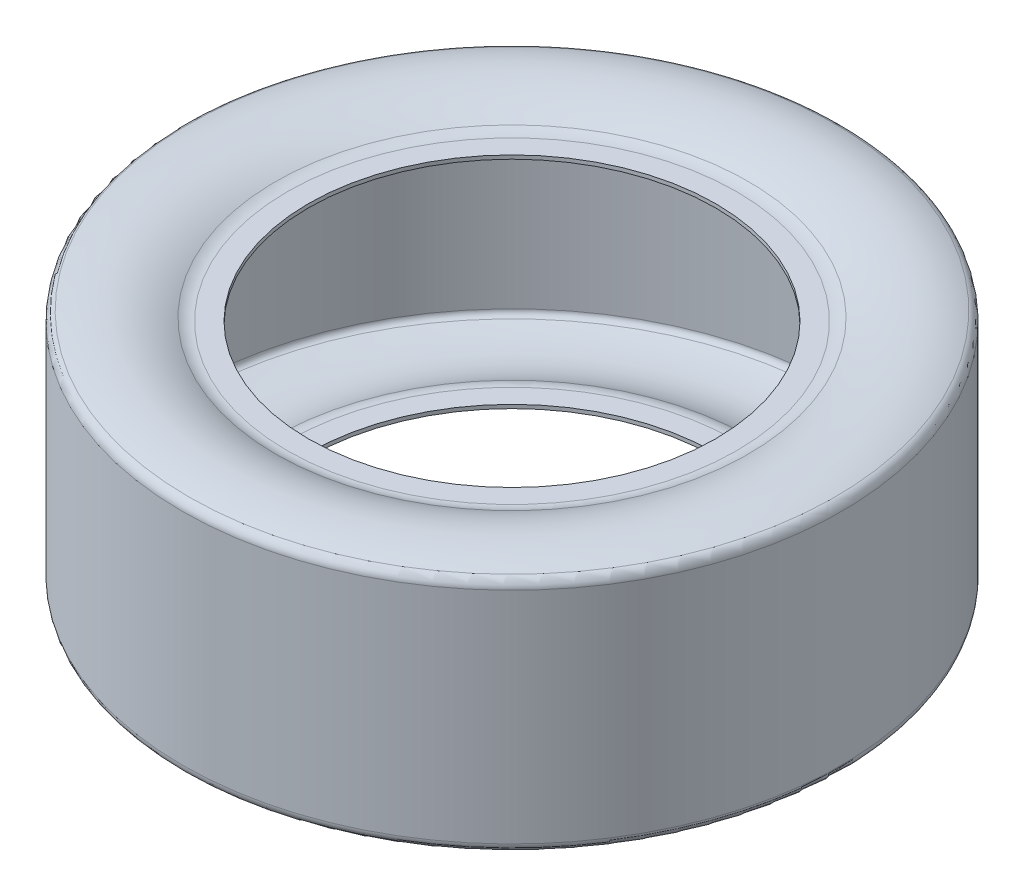
ISO-10303-21;
HEADER;
FILE_DESCRIPTION(('STEP AP214'),'2;1');
FILE_NAME('part.step','',(''),(''),'','','');
FILE_SCHEMA(('AUTOMOTIVE_DESIGN { 1 0 10303 214 1 1 1 1 }'));
ENDSEC;
DATA;
#1=APPLICATION_CONTEXT('core data for automotive mechanical design processes');
#2=APPLICATION_PROTOCOL_DEFINITION('international standard','automotive_design',2000,#1);
#3=PRODUCT_CONTEXT('',#1,'mechanical');
#4=PRODUCT('Part','Part','',(#3));
#5=PRODUCT_RELATED_PRODUCT_CATEGORY('part','',(#4));
#6=PRODUCT_DEFINITION_FORMATION('','',#4);
#7=PRODUCT_DEFINITION_CONTEXT('part definition',#1,'design');
#8=PRODUCT_DEFINITION('design','',#6,#7);
#9=PRODUCT_DEFINITION_SHAPE('','',#8);
#10=(LENGTH_UNIT() NAMED_UNIT(*) SI_UNIT(.MILLI.,.METRE.));
#11=(NAMED_UNIT(*) PLANE_ANGLE_UNIT() SI_UNIT($,.RADIAN.));
#12=(NAMED_UNIT(*) SI_UNIT($,.STERADIAN.) SOLID_ANGLE_UNIT());
#13=UNCERTAINTY_MEASURE_WITH_UNIT(LENGTH_MEASURE(1.E-05),#10,'distance_accuracy_value','');
#14=(GEOMETRIC_REPRESENTATION_CONTEXT(3) GLOBAL_UNCERTAINTY_ASSIGNED_CONTEXT((#13)) GLOBAL_UNIT_ASSIGNED_CONTEXT((#10,
#11,#12)) REPRESENTATION_CONTEXT('',''));
#15=CARTESIAN_POINT('',(0.,0.,0.));
#16=DIRECTION('',(0.,0.,1.));
#17=DIRECTION('',(1.,0.,0.));
#18=AXIS2_PLACEMENT_3D('',#15,#16,#17);
#19=CARTESIAN_POINT('',(0.,-44.45,0.));
#20=DIRECTION('',(0.,1.,0.));
#21=DIRECTION('',(0.,0.,1.));
#22=AXIS2_PLACEMENT_3D('',#19,#20,#21);
#23=CYLINDRICAL_SURFACE('',#22,263.7);
#24=CARTESIAN_POINT('',(0.,-88.9,0.));
#25=DIRECTION('',(0.,1.,0.));
#26=DIRECTION('',(0.,0.,1.));
#27=AXIS2_PLACEMENT_3D('',#24,#25,#26);
#28=CIRCLE('',#27,263.7);
#29=CARTESIAN_POINT('',(0.,-88.9,263.7));
#30=VERTEX_POINT('',#29);
#31=EDGE_CURVE('E241',#30,#30,#28,.F.);
#32=ORIENTED_EDGE('',*,*,#31,.T.);
#33=EDGE_LOOP('',(#32));
#34=FACE_BOUND('',#33,.T.);
#35=CARTESIAN_POINT('',(0.,88.9,0.));
#36=DIRECTION('',(0.,1.,0.));
#37=DIRECTION('',(0.,0.,1.));
#38=AXIS2_PLACEMENT_3D('',#35,#36,#37);
#39=CIRCLE('',#38,263.7);
#40=CARTESIAN_POINT('',(0.,88.9,263.7));
#41=VERTEX_POINT('',#40);
#42=EDGE_CURVE('E238',#41,#41,#39,.T.);
#43=ORIENTED_EDGE('',*,*,#42,.T.);
#44=EDGE_LOOP('',(#43));
#45=FACE_BOUND('',#44,.T.);
#46=ADVANCED_FACE('F14',(#34,#45),#23,.F.);
#47=CARTESIAN_POINT('',(0.,-88.9,0.));
#48=DIRECTION('',(0.,1.,0.));
#49=DIRECTION('',(0.,0.,1.));
#50=AXIS2_PLACEMENT_3D('',#47,#48,#49);
#51=TOROIDAL_SURFACE('',#50,258.7,4.99999999999994);
#52=ORIENTED_EDGE('',*,*,#31,.F.);
#53=EDGE_LOOP('',(#52));
#54=FACE_BOUND('',#53,.T.);
#55=CARTESIAN_POINT('',(0.,-93.5989720176161,0.));
#56=DIRECTION('',(0.,1.,0.));
#57=DIRECTION('',(0.,0.,1.));
#58=AXIS2_PLACEMENT_3D('',#55,#56,#57);
#59=CIRCLE('',#58,260.408701839895);
#60=CARTESIAN_POINT('',(0.,-93.5989720176161,260.408701839895));
#61=VERTEX_POINT('',#60);
#62=EDGE_CURVE('E219',#61,#61,#59,.F.);
#63=ORIENTED_EDGE('',*,*,#62,.T.);
#64=EDGE_LOOP('',(#63));
#65=FACE_BOUND('',#64,.T.);
#66=ADVANCED_FACE('F232',(#54,#65),#51,.F.);
#67=CARTESIAN_POINT('',(0.,88.9,0.));
#68=DIRECTION('',(0.,1.,0.));
#69=DIRECTION('',(0.,0.,1.));
#70=AXIS2_PLACEMENT_3D('',#67,#68,#69);
#71=TOROIDAL_SURFACE('',#70,258.7,4.99999999999994);
#72=CARTESIAN_POINT('',(0.,93.5989720176161,0.));
#73=DIRECTION('',(0.,1.,0.));
#74=DIRECTION('',(0.,0.,1.));
#75=AXIS2_PLACEMENT_3D('',#72,#73,#74);
#76=CIRCLE('',#75,260.408701839895);
#77=CARTESIAN_POINT('',(0.,93.5989720176161,260.408701839895));
#78=VERTEX_POINT('',#77);
#79=EDGE_CURVE('E216',#78,#78,#76,.T.);
#80=ORIENTED_EDGE('',*,*,#79,.T.);
#81=EDGE_LOOP('',(#80));
#82=FACE_BOUND('',#81,.T.);
#83=ORIENTED_EDGE('',*,*,#42,.F.);
#84=EDGE_LOOP('',(#83));
#85=FACE_BOUND('',#84,.T.);
#86=ADVANCED_FACE('F228',(#82,#85),#71,.F.);
#87=CARTESIAN_POINT('',(0.,-15.5341676680611,0.));
#88=DIRECTION('',(0.,1.,0.));
#89=DIRECTION('',(0.,0.,1.));
#90=AXIS2_PLACEMENT_3D('',#87,#88,#89);
#91=TOROIDAL_SURFACE('',#90,232.021753732297,83.0658323319388);
#92=ORIENTED_EDGE('',*,*,#62,.F.);
#93=EDGE_LOOP('',(#92));
#94=FACE_BOUND('',#93,.T.);
#95=CARTESIAN_POINT('',(0.,-88.6539500098942,0.));
#96=DIRECTION('',(0.,1.,0.));
#97=DIRECTION('',(0.,0.,1.));
#98=AXIS2_PLACEMENT_3D('',#95,#96,#97);
#99=CIRCLE('',#98,192.608178262914);
#100=CARTESIAN_POINT('',(0.,-88.6539500098942,192.608178262914));
#101=VERTEX_POINT('',#100);
#102=EDGE_CURVE('E180',#101,#101,#99,.T.);
#103=ORIENTED_EDGE('',*,*,#102,.F.);
#104=EDGE_LOOP('',(#103));
#105=FACE_BOUND('',#104,.T.);
#106=ADVANCED_FACE('F225',(#94,#105),#91,.F.);
#107=CARTESIAN_POINT('',(0.,15.5341676680611,0.));
#108=DIRECTION('',(0.,1.,0.));
#109=DIRECTION('',(0.,0.,1.));
#110=AXIS2_PLACEMENT_3D('',#107,#108,#109);
#111=TOROIDAL_SURFACE('',#110,232.021753732297,83.0658323319388);
#112=CARTESIAN_POINT('',(0.,88.6539500098942,0.));
#113=DIRECTION('',(0.,1.,0.));
#114=DIRECTION('',(0.,0.,1.));
#115=AXIS2_PLACEMENT_3D('',#112,#113,#114);
#116=CIRCLE('',#115,192.608178262914);
#117=CARTESIAN_POINT('',(0.,88.6539500098942,192.608178262914));
#118=VERTEX_POINT('',#117);
#119=EDGE_CURVE('E176',#118,#118,#116,.F.);
#120=ORIENTED_EDGE('',*,*,#119,.F.);
#121=EDGE_LOOP('',(#120));
#122=FACE_BOUND('',#121,.T.);
#123=ORIENTED_EDGE('',*,*,#79,.F.);
#124=EDGE_LOOP('',(#123));
#125=FACE_BOUND('',#124,.T.);
#126=ADVANCED_FACE('F200',(#122,#125),#111,.F.);
#127=CARTESIAN_POINT('',(0.,-108.9,0.));
#128=DIRECTION('',(0.,1.,0.));
#129=DIRECTION('',(0.,0.,1.));
#130=AXIS2_PLACEMENT_3D('',#127,#128,#129);
#131=TOROIDAL_SURFACE('',#130,181.695,23.0000000000001);
#132=ORIENTED_EDGE('',*,*,#102,.T.);
#133=EDGE_LOOP('',(#132));
#134=FACE_BOUND('',#133,.T.);
#135=CARTESIAN_POINT('',(0.,-85.8999999999999,0.));
#136=DIRECTION('',(0.,-1.,0.));
#137=DIRECTION('',(0.,0.,-1.));
#138=AXIS2_PLACEMENT_3D('',#135,#136,#137);
#139=CIRCLE('',#138,181.695000000036);
#140=CARTESIAN_POINT('',(0.,-85.8999999999999,-181.695000000036));
#141=VERTEX_POINT('',#140);
#142=EDGE_CURVE('E179',#141,#141,#139,.F.);
#143=ORIENTED_EDGE('',*,*,#142,.F.);
#144=EDGE_LOOP('',(#143));
#145=FACE_BOUND('',#144,.T.);
#146=ADVANCED_FACE('F196',(#134,#145),#131,.T.);
#147=CARTESIAN_POINT('',(0.,108.9,0.));
#148=DIRECTION('',(0.,1.,0.));
#149=DIRECTION('',(0.,0.,1.));
#150=AXIS2_PLACEMENT_3D('',#147,#148,#149);
#151=TOROIDAL_SURFACE('',#150,181.695,23.0000000000001);
#152=CARTESIAN_POINT('',(0.,85.8999999999999,0.));
#153=DIRECTION('',(0.,1.,0.));
#154=DIRECTION('',(0.,0.,-1.));
#155=AXIS2_PLACEMENT_3D('',#152,#153,#154);
#156=CIRCLE('',#155,181.695000000036);
#157=CARTESIAN_POINT('',(0.,85.8999999999999,-181.695000000036));
#158=VERTEX_POINT('',#157);
#159=EDGE_CURVE('E140',#158,#158,#156,.F.);
#160=ORIENTED_EDGE('',*,*,#159,.F.);
#161=EDGE_LOOP('',(#160));
#162=FACE_BOUND('',#161,.T.);
#163=ORIENTED_EDGE('',*,*,#119,.T.);
#164=EDGE_LOOP('',(#163));
#165=FACE_BOUND('',#164,.T.);
#166=ADVANCED_FACE('F162',(#162,#165),#151,.T.);
#167=CARTESIAN_POINT('',(0.,-85.8999999999999,-164.825));
#168=DIRECTION('',(0.,1.,0.));
#169=DIRECTION('',(0.,0.,1.));
#170=AXIS2_PLACEMENT_3D('',#167,#168,#169);
#171=PLANE('',#170);
#172=CARTESIAN_POINT('',(0.,-85.8999999999999,0.));
#173=DIRECTION('',(0.,1.,0.));
#174=DIRECTION('',(0.,0.,1.));
#175=AXIS2_PLACEMENT_3D('',#172,#173,#174);
#176=CIRCLE('',#175,164.825);
#177=CARTESIAN_POINT('',(0.,-85.8999999999999,164.825));
#178=VERTEX_POINT('',#177);
#179=EDGE_CURVE('E17',#178,#178,#176,.F.);
#180=ORIENTED_EDGE('',*,*,#179,.T.);
#181=EDGE_LOOP('',(#180));
#182=FACE_BOUND('',#181,.T.);
#183=ORIENTED_EDGE('',*,*,#142,.T.);
#184=EDGE_LOOP('',(#183));
#185=FACE_BOUND('',#184,.T.);
#186=ADVANCED_FACE('F157',(#182,#185),#171,.T.);
#187=CARTESIAN_POINT('',(0.,85.9,-181.695000000036));
#188=DIRECTION('',(0.,-1.,0.));
#189=DIRECTION('',(0.,0.,-1.));
#190=AXIS2_PLACEMENT_3D('',#187,#188,#189);
#191=PLANE('',#190);
#192=CARTESIAN_POINT('',(0.,85.8999999999999,0.));
#193=DIRECTION('',(0.,1.,0.));
#194=DIRECTION('',(0.,0.,1.));
#195=AXIS2_PLACEMENT_3D('',#192,#193,#194);
#196=CIRCLE('',#195,164.825);
#197=CARTESIAN_POINT('',(0.,85.8999999999999,164.825));
#198=VERTEX_POINT('',#197);
#199=EDGE_CURVE('E254',#198,#198,#196,.T.);
#200=ORIENTED_EDGE('',*,*,#199,.T.);
#201=EDGE_LOOP('',(#200));
#202=FACE_BOUND('',#201,.T.);
#203=ORIENTED_EDGE('',*,*,#159,.T.);
#204=EDGE_LOOP('',(#203));
#205=FACE_BOUND('',#204,.T.);
#206=ADVANCED_FACE('F147',(#202,#205),#191,.T.);
#207=CARTESIAN_POINT('',(0.,-87.3999999999999,0.));
#208=DIRECTION('',(0.,1.,0.));
#209=DIRECTION('',(0.,0.,1.));
#210=AXIS2_PLACEMENT_3D('',#207,#208,#209);
#211=CYLINDRICAL_SURFACE('',#210,164.825);
#212=ORIENTED_EDGE('',*,*,#179,.F.);
#213=EDGE_LOOP('',(#212));
#214=FACE_BOUND('',#213,.T.);
#215=CARTESIAN_POINT('',(0.,-88.9,0.));
#216=DIRECTION('',(0.,1.,0.));
#217=DIRECTION('',(0.,0.,1.));
#218=AXIS2_PLACEMENT_3D('',#215,#216,#217);
#219=CIRCLE('',#218,164.825);
#220=CARTESIAN_POINT('',(0.,-88.9,164.825));
#221=VERTEX_POINT('',#220);
#222=EDGE_CURVE('E252',#221,#221,#219,.T.);
#223=ORIENTED_EDGE('',*,*,#222,.F.);
#224=EDGE_LOOP('',(#223));
#225=FACE_BOUND('',#224,.T.);
#226=ADVANCED_FACE('F156',(#214,#225),#211,.F.);
#227=CARTESIAN_POINT('',(0.,87.3999999999999,0.));
#228=DIRECTION('',(0.,1.,0.));
#229=DIRECTION('',(0.,0.,1.));
#230=AXIS2_PLACEMENT_3D('',#227,#228,#229);
#231=CYLINDRICAL_SURFACE('',#230,164.825);
#232=CARTESIAN_POINT('',(0.,88.9,0.));
#233=DIRECTION('',(0.,1.,0.));
#234=DIRECTION('',(0.,0.,1.));
#235=AXIS2_PLACEMENT_3D('',#232,#233,#234);
#236=CIRCLE('',#235,164.825);
#237=CARTESIAN_POINT('',(0.,88.9,164.825));
#238=VERTEX_POINT('',#237);
#239=EDGE_CURVE('E249',#238,#238,#236,.F.);
#240=ORIENTED_EDGE('',*,*,#239,.F.);
#241=EDGE_LOOP('',(#240));
#242=FACE_BOUND('',#241,.T.);
#243=ORIENTED_EDGE('',*,*,#199,.F.);
#244=EDGE_LOOP('',(#243));
#245=FACE_BOUND('',#244,.T.);
#246=ADVANCED_FACE('F110',(#242,#245),#231,.F.);
#247=CARTESIAN_POINT('',(0.,-88.9,-181.695));
#248=DIRECTION('',(0.,-1.,0.));
#249=DIRECTION('',(0.,0.,-1.));
#250=AXIS2_PLACEMENT_3D('',#247,#248,#249);
#251=PLANE('',#250);
#252=ORIENTED_EDGE('',*,*,#222,.T.);
#253=EDGE_LOOP('',(#252));
#254=FACE_BOUND('',#253,.T.);
#255=CARTESIAN_POINT('',(0.,-88.9,0.));
#256=DIRECTION('',(0.,1.,0.));
#257=DIRECTION('',(0.,0.,-1.));
#258=AXIS2_PLACEMENT_3D('',#255,#256,#257);
#259=CIRCLE('',#258,181.695);
#260=CARTESIAN_POINT('',(0.,-88.9,-181.695));
#261=VERTEX_POINT('',#260);
#262=EDGE_CURVE('E127',#261,#261,#259,.F.);
#263=ORIENTED_EDGE('',*,*,#262,.T.);
#264=EDGE_LOOP('',(#263));
#265=FACE_BOUND('',#264,.T.);
#266=ADVANCED_FACE('F105',(#254,#265),#251,.T.);
#267=CARTESIAN_POINT('',(0.,88.9,-164.825));
#268=DIRECTION('',(0.,1.,0.));
#269=DIRECTION('',(0.,0.,1.));
#270=AXIS2_PLACEMENT_3D('',#267,#268,#269);
#271=PLANE('',#270);
#272=ORIENTED_EDGE('',*,*,#239,.T.);
#273=EDGE_LOOP('',(#272));
#274=FACE_BOUND('',#273,.T.);
#275=CARTESIAN_POINT('',(0.,88.9,0.));
#276=DIRECTION('',(0.,-1.,0.));
#277=DIRECTION('',(0.,0.,-1.));
#278=AXIS2_PLACEMENT_3D('',#275,#276,#277);
#279=CIRCLE('',#278,181.695);
#280=CARTESIAN_POINT('',(0.,88.9,-181.695));
#281=VERTEX_POINT('',#280);
#282=EDGE_CURVE('E92',#281,#281,#279,.F.);
#283=ORIENTED_EDGE('',*,*,#282,.T.);
#284=EDGE_LOOP('',(#283));
#285=FACE_BOUND('',#284,.T.);
#286=ADVANCED_FACE('F96',(#274,#285),#271,.T.);
#287=CARTESIAN_POINT('',(0.,-108.9,0.));
#288=DIRECTION('',(0.,1.,0.));
#289=DIRECTION('',(0.,0.,1.));
#290=AXIS2_PLACEMENT_3D('',#287,#288,#289);
#291=TOROIDAL_SURFACE('',#290,181.695,20.);
#292=ORIENTED_EDGE('',*,*,#262,.F.);
#293=EDGE_LOOP('',(#292));
#294=FACE_BOUND('',#293,.T.);
#295=CARTESIAN_POINT('',(0.,-91.2947391390385,0.));
#296=DIRECTION('',(0.,1.,0.));
#297=DIRECTION('',(0.,0.,1.));
#298=AXIS2_PLACEMENT_3D('',#295,#296,#297);
#299=CIRCLE('',#298,191.184720228621);
#300=CARTESIAN_POINT('',(0.,-91.2947391390385,191.184720228621));
#301=VERTEX_POINT('',#300);
#302=EDGE_CURVE('E63',#301,#301,#299,.T.);
#303=ORIENTED_EDGE('',*,*,#302,.F.);
#304=EDGE_LOOP('',(#303));
#305=FACE_BOUND('',#304,.T.);
#306=ADVANCED_FACE('F78',(#294,#305),#291,.F.);
#307=CARTESIAN_POINT('',(0.,108.9,0.));
#308=DIRECTION('',(0.,1.,0.));
#309=DIRECTION('',(0.,0.,1.));
#310=AXIS2_PLACEMENT_3D('',#307,#308,#309);
#311=TOROIDAL_SURFACE('',#310,181.695,20.);
#312=CARTESIAN_POINT('',(0.,91.2947391390385,0.));
#313=DIRECTION('',(0.,1.,0.));
#314=DIRECTION('',(0.,0.,1.));
#315=AXIS2_PLACEMENT_3D('',#312,#313,#314);
#316=CIRCLE('',#315,191.184720228621);
#317=CARTESIAN_POINT('',(0.,91.2947391390385,191.184720228621));
#318=VERTEX_POINT('',#317);
#319=EDGE_CURVE('E57',#318,#318,#316,.F.);
#320=ORIENTED_EDGE('',*,*,#319,.F.);
#321=EDGE_LOOP('',(#320));
#322=FACE_BOUND('',#321,.T.);
#323=ORIENTED_EDGE('',*,*,#282,.F.);
#324=EDGE_LOOP('',(#323));
#325=FACE_BOUND('',#324,.T.);
#326=ADVANCED_FACE('F72',(#322,#325),#311,.F.);
#327=CARTESIAN_POINT('',(0.,-15.5341676680611,0.));
#328=DIRECTION('',(0.,1.,0.));
#329=DIRECTION('',(0.,0.,1.));
#330=AXIS2_PLACEMENT_3D('',#327,#328,#329);
#331=TOROIDAL_SURFACE('',#330,232.021753732297,86.0658323319389);
#332=ORIENTED_EDGE('',*,*,#302,.T.);
#333=EDGE_LOOP('',(#332));
#334=FACE_BOUND('',#333,.T.);
#335=CARTESIAN_POINT('',(0.,-96.4183552281858,0.));
#336=DIRECTION('',(0.,1.,0.));
#337=DIRECTION('',(0.,0.,1.));
#338=AXIS2_PLACEMENT_3D('',#335,#336,#337);
#339=CIRCLE('',#338,261.433922943832);
#340=CARTESIAN_POINT('',(0.,-96.4183552281858,261.433922943832));
#341=VERTEX_POINT('',#340);
#342=EDGE_CURVE('E54',#341,#341,#339,.T.);
#343=ORIENTED_EDGE('',*,*,#342,.F.);
#344=EDGE_LOOP('',(#343));
#345=FACE_BOUND('',#344,.T.);
#346=ADVANCED_FACE('F69',(#334,#345),#331,.T.);
#347=CARTESIAN_POINT('',(0.,15.5341676680611,0.));
#348=DIRECTION('',(0.,1.,0.));
#349=DIRECTION('',(0.,0.,1.));
#350=AXIS2_PLACEMENT_3D('',#347,#348,#349);
#351=TOROIDAL_SURFACE('',#350,232.021753732297,86.0658323319389);
#352=CARTESIAN_POINT('',(0.,96.4183552281858,0.));
#353=DIRECTION('',(0.,1.,0.));
#354=DIRECTION('',(0.,0.,1.));
#355=AXIS2_PLACEMENT_3D('',#352,#353,#354);
#356=CIRCLE('',#355,261.433922943832);
#357=CARTESIAN_POINT('',(0.,96.4183552281858,261.433922943832));
#358=VERTEX_POINT('',#357);
#359=EDGE_CURVE('E26',#358,#358,#356,.F.);
#360=ORIENTED_EDGE('',*,*,#359,.F.);
#361=EDGE_LOOP('',(#360));
#362=FACE_BOUND('',#361,.T.);
#363=ORIENTED_EDGE('',*,*,#319,.T.);
#364=EDGE_LOOP('',(#363));
#365=FACE_BOUND('',#364,.T.);
#366=ADVANCED_FACE('F47',(#362,#365),#351,.T.);
#367=CARTESIAN_POINT('',(0.,-88.9,0.));
#368=DIRECTION('',(0.,1.,0.));
#369=DIRECTION('',(0.,0.,1.));
#370=AXIS2_PLACEMENT_3D('',#367,#368,#369);
#371=TOROIDAL_SURFACE('',#370,258.7,8.);
#372=ORIENTED_EDGE('',*,*,#342,.T.);
#373=EDGE_LOOP('',(#372));
#374=FACE_BOUND('',#373,.T.);
#375=CARTESIAN_POINT('',(0.,-88.9,0.));
#376=DIRECTION('',(0.,1.,0.));
#377=DIRECTION('',(0.,0.,1.));
#378=AXIS2_PLACEMENT_3D('',#375,#376,#377);
#379=CIRCLE('',#378,266.7);
#380=CARTESIAN_POINT('',(0.,-88.9,266.7));
#381=VERTEX_POINT('',#380);
#382=EDGE_CURVE('E21',#381,#381,#379,.T.);
#383=ORIENTED_EDGE('',*,*,#382,.F.);
#384=EDGE_LOOP('',(#383));
#385=FACE_BOUND('',#384,.T.);
#386=ADVANCED_FACE('F42',(#374,#385),#371,.T.);
#387=CARTESIAN_POINT('',(0.,88.9,0.));
#388=DIRECTION('',(0.,1.,0.));
#389=DIRECTION('',(0.,0.,1.));
#390=AXIS2_PLACEMENT_3D('',#387,#388,#389);
#391=TOROIDAL_SURFACE('',#390,258.7,8.);
#392=CARTESIAN_POINT('',(0.,88.9,0.));
#393=DIRECTION('',(0.,1.,0.));
#394=DIRECTION('',(0.,0.,1.));
#395=AXIS2_PLACEMENT_3D('',#392,#393,#394);
#396=CIRCLE('',#395,266.7);
#397=CARTESIAN_POINT('',(0.,88.9,266.7));
#398=VERTEX_POINT('',#397);
#399=EDGE_CURVE('E10',#398,#398,#396,.F.);
#400=ORIENTED_EDGE('',*,*,#399,.F.);
#401=EDGE_LOOP('',(#400));
#402=FACE_BOUND('',#401,.T.);
#403=ORIENTED_EDGE('',*,*,#359,.T.);
#404=EDGE_LOOP('',(#403));
#405=FACE_BOUND('',#404,.T.);
#406=ADVANCED_FACE('F37',(#402,#405),#391,.T.);
#407=CARTESIAN_POINT('',(0.,44.45,0.));
#408=DIRECTION('',(0.,1.,0.));
#409=DIRECTION('',(0.,0.,1.));
#410=AXIS2_PLACEMENT_3D('',#407,#408,#409);
#411=CYLINDRICAL_SURFACE('',#410,266.7);
#412=ORIENTED_EDGE('',*,*,#399,.T.);
#413=EDGE_LOOP('',(#412));
#414=FACE_BOUND('',#413,.T.);
#415=ORIENTED_EDGE('',*,*,#382,.T.);
#416=EDGE_LOOP('',(#415));
#417=FACE_BOUND('',#416,.T.);
#418=ADVANCED_FACE('F41',(#414,#417),#411,.T.);
#419=CLOSED_SHELL('',(#46,#66,#86,#106,#126,#146,#166,#186,#206,#226,#246,#266,#286,#306,#326,
#346,#366,#386,#406,#418));
#420=MANIFOLD_SOLID_BREP('B1',#419);
#421=ADVANCED_BREP_SHAPE_REPRESENTATION('',(#18,#420),#14);
#422=SHAPE_DEFINITION_REPRESENTATION(#9,#421);
ENDSEC;
END-ISO-10303-21;
